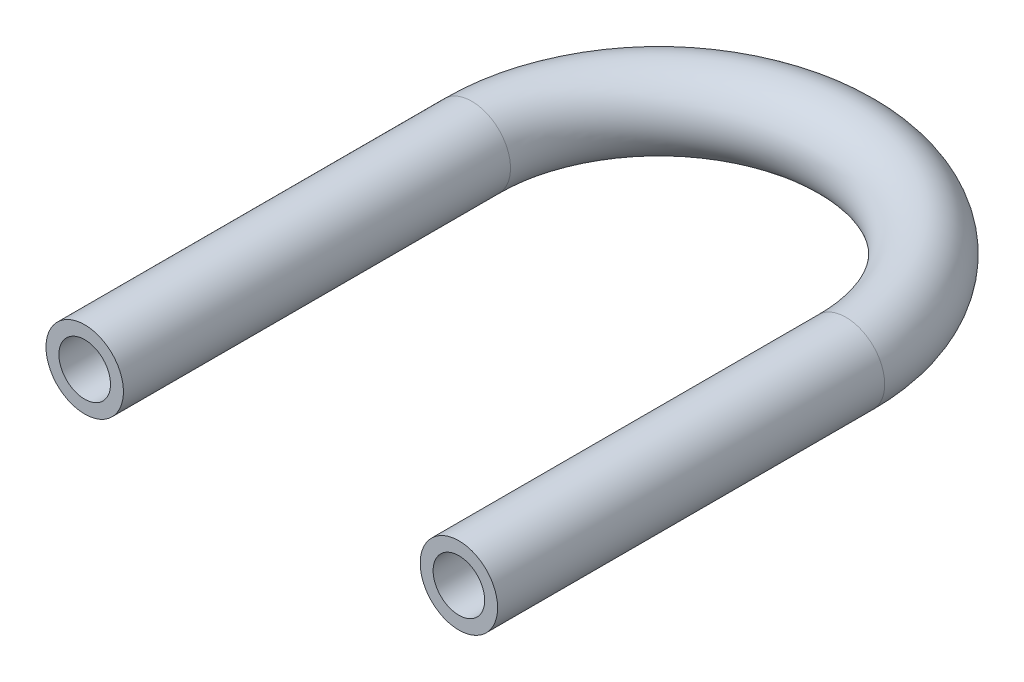
ISO-10303-21;
HEADER;
FILE_DESCRIPTION(('STEP AP214'),'2;1');
FILE_NAME('part.step','',(''),(''),'','','');
FILE_SCHEMA(('AUTOMOTIVE_DESIGN { 1 0 10303 214 1 1 1 1 }'));
ENDSEC;
DATA;
#1=APPLICATION_CONTEXT('core data for automotive mechanical design processes');
#2=APPLICATION_PROTOCOL_DEFINITION('international standard','automotive_design',2000,#1);
#3=PRODUCT_CONTEXT('',#1,'mechanical');
#4=PRODUCT('Part','Part','',(#3));
#5=PRODUCT_RELATED_PRODUCT_CATEGORY('part','',(#4));
#6=PRODUCT_DEFINITION_FORMATION('','',#4);
#7=PRODUCT_DEFINITION_CONTEXT('part definition',#1,'design');
#8=PRODUCT_DEFINITION('design','',#6,#7);
#9=PRODUCT_DEFINITION_SHAPE('','',#8);
#10=(LENGTH_UNIT() NAMED_UNIT(*) SI_UNIT(.MILLI.,.METRE.));
#11=(NAMED_UNIT(*) PLANE_ANGLE_UNIT() SI_UNIT($,.RADIAN.));
#12=(NAMED_UNIT(*) SI_UNIT($,.STERADIAN.) SOLID_ANGLE_UNIT());
#13=UNCERTAINTY_MEASURE_WITH_UNIT(LENGTH_MEASURE(1.E-05),#10,'distance_accuracy_value','');
#14=(GEOMETRIC_REPRESENTATION_CONTEXT(3) GLOBAL_UNCERTAINTY_ASSIGNED_CONTEXT((#13)) GLOBAL_UNIT_ASSIGNED_CONTEXT((#10,
#11,#12)) REPRESENTATION_CONTEXT('',''));
#15=CARTESIAN_POINT('',(0.,0.,0.));
#16=DIRECTION('',(0.,0.,1.));
#17=DIRECTION('',(1.,0.,0.));
#18=AXIS2_PLACEMENT_3D('',#15,#16,#17);
#19=CARTESIAN_POINT('',(-14.5,0.,30.));
#20=DIRECTION('',(0.,0.,-1.));
#21=DIRECTION('',(-1.,0.,0.));
#22=AXIS2_PLACEMENT_3D('',#19,#20,#21);
#23=CYLINDRICAL_SURFACE('',#22,3.);
#24=CARTESIAN_POINT('',(-14.5,0.,0.));
#25=DIRECTION('',(0.,0.,-1.));
#26=DIRECTION('',(-1.,0.,0.));
#27=AXIS2_PLACEMENT_3D('',#24,#25,#26);
#28=CIRCLE('',#27,3.);
#29=CARTESIAN_POINT('',(-17.5,0.,0.));
#30=VERTEX_POINT('',#29);
#31=EDGE_CURVE('E64',#30,#30,#28,.T.);
#32=ORIENTED_EDGE('',*,*,#31,.F.);
#33=EDGE_LOOP('',(#32));
#34=FACE_BOUND('',#33,.T.);
#35=CARTESIAN_POINT('',(-14.5,0.,30.));
#36=DIRECTION('',(0.,0.,-1.));
#37=DIRECTION('',(-1.,0.,0.));
#38=AXIS2_PLACEMENT_3D('',#35,#36,#37);
#39=CIRCLE('',#38,3.);
#40=CARTESIAN_POINT('',(-17.5,0.,30.));
#41=VERTEX_POINT('',#40);
#42=EDGE_CURVE('E61',#41,#41,#39,.T.);
#43=ORIENTED_EDGE('',*,*,#42,.T.);
#44=EDGE_LOOP('',(#43));
#45=FACE_BOUND('',#44,.T.);
#46=ADVANCED_FACE('F37',(#34,#45),#23,.T.);
#47=CARTESIAN_POINT('',(0.,0.,0.));
#48=DIRECTION('',(0.,-1.,0.));
#49=DIRECTION('',(0.,0.,-1.));
#50=AXIS2_PLACEMENT_3D('',#47,#48,#49);
#51=TOROIDAL_SURFACE('',#50,14.5,3.);
#52=CARTESIAN_POINT('',(14.5,0.,0.));
#53=DIRECTION('',(0.,0.,1.));
#54=DIRECTION('',(1.,0.,0.));
#55=AXIS2_PLACEMENT_3D('',#52,#53,#54);
#56=CIRCLE('',#55,3.);
#57=CARTESIAN_POINT('',(17.5,0.,0.));
#58=VERTEX_POINT('',#57);
#59=EDGE_CURVE('E41',#58,#58,#56,.T.);
#60=CARTESIAN_POINT('',(0.,0.,0.));
#61=DIRECTION('',(0.,-1.,0.));
#62=DIRECTION('',(0.,0.,-1.));
#63=AXIS2_PLACEMENT_3D('',#60,#61,#62);
#64=CIRCLE('',#63,17.5);
#65=EDGE_CURVE('',#30,#58,#64,.T.);
#66=ORIENTED_EDGE('',*,*,#31,.T.);
#67=ORIENTED_EDGE('',*,*,#59,.F.);
#68=ORIENTED_EDGE('',*,*,#65,.T.);
#69=ORIENTED_EDGE('',*,*,#65,.F.);
#70=EDGE_LOOP('',(#66,#68,#67,#69));
#71=FACE_BOUND('',#70,.T.);
#72=ADVANCED_FACE('F74',(#71),#51,.T.);
#73=CARTESIAN_POINT('',(14.5,0.,0.));
#74=DIRECTION('',(0.,0.,1.));
#75=DIRECTION('',(1.,0.,0.));
#76=AXIS2_PLACEMENT_3D('',#73,#74,#75);
#77=CYLINDRICAL_SURFACE('',#76,3.);
#78=CARTESIAN_POINT('',(14.5,0.,30.));
#79=DIRECTION('',(0.,0.,1.));
#80=DIRECTION('',(1.,0.,0.));
#81=AXIS2_PLACEMENT_3D('',#78,#79,#80);
#82=CIRCLE('',#81,3.);
#83=CARTESIAN_POINT('',(17.5,0.,30.));
#84=VERTEX_POINT('',#83);
#85=EDGE_CURVE('E56',#84,#84,#82,.T.);
#86=ORIENTED_EDGE('',*,*,#85,.F.);
#87=EDGE_LOOP('',(#86));
#88=FACE_BOUND('',#87,.T.);
#89=ORIENTED_EDGE('',*,*,#59,.T.);
#90=EDGE_LOOP('',(#89));
#91=FACE_BOUND('',#90,.T.);
#92=ADVANCED_FACE('F39',(#88,#91),#77,.T.);
#93=CARTESIAN_POINT('',(-14.5,0.,30.));
#94=DIRECTION('',(0.,0.,-1.));
#95=DIRECTION('',(-1.,0.,0.));
#96=AXIS2_PLACEMENT_3D('',#93,#94,#95);
#97=PLANE('',#96);
#98=CARTESIAN_POINT('',(-14.5,0.,30.));
#99=DIRECTION('',(0.,0.,-1.));
#100=DIRECTION('',(-1.,0.,0.));
#101=AXIS2_PLACEMENT_3D('',#98,#99,#100);
#102=CIRCLE('',#101,2.);
#103=CARTESIAN_POINT('',(-16.5,0.,30.));
#104=VERTEX_POINT('',#103);
#105=EDGE_CURVE('E60',#104,#104,#102,.F.);
#106=ORIENTED_EDGE('',*,*,#105,.F.);
#107=EDGE_LOOP('',(#106));
#108=FACE_BOUND('',#107,.T.);
#109=ORIENTED_EDGE('',*,*,#42,.F.);
#110=EDGE_LOOP('',(#109));
#111=FACE_BOUND('',#110,.T.);
#112=ADVANCED_FACE('F80',(#108,#111),#97,.F.);
#113=CARTESIAN_POINT('',(14.5,0.,30.));
#114=DIRECTION('',(0.,0.,1.));
#115=DIRECTION('',(1.,0.,0.));
#116=AXIS2_PLACEMENT_3D('',#113,#114,#115);
#117=PLANE('',#116);
#118=CARTESIAN_POINT('',(14.5,0.,30.));
#119=DIRECTION('',(0.,0.,1.));
#120=DIRECTION('',(1.,0.,0.));
#121=AXIS2_PLACEMENT_3D('',#118,#119,#120);
#122=CIRCLE('',#121,2.);
#123=CARTESIAN_POINT('',(16.5,0.,30.));
#124=VERTEX_POINT('',#123);
#125=EDGE_CURVE('E10',#124,#124,#122,.F.);
#126=ORIENTED_EDGE('',*,*,#125,.T.);
#127=EDGE_LOOP('',(#126));
#128=FACE_BOUND('',#127,.T.);
#129=ORIENTED_EDGE('',*,*,#85,.T.);
#130=EDGE_LOOP('',(#129));
#131=FACE_BOUND('',#130,.T.);
#132=ADVANCED_FACE('F98',(#128,#131),#117,.T.);
#133=CARTESIAN_POINT('',(-14.5,0.,30.));
#134=DIRECTION('',(0.,0.,-1.));
#135=DIRECTION('',(-1.,0.,0.));
#136=AXIS2_PLACEMENT_3D('',#133,#134,#135);
#137=CYLINDRICAL_SURFACE('',#136,2.);
#138=CARTESIAN_POINT('',(-14.5,0.,0.));
#139=DIRECTION('',(0.,0.,-1.));
#140=DIRECTION('',(-1.,0.,0.));
#141=AXIS2_PLACEMENT_3D('',#138,#139,#140);
#142=CIRCLE('',#141,2.);
#143=CARTESIAN_POINT('',(-16.5,0.,0.));
#144=VERTEX_POINT('',#143);
#145=EDGE_CURVE('E52',#144,#144,#142,.F.);
#146=ORIENTED_EDGE('',*,*,#145,.F.);
#147=EDGE_LOOP('',(#146));
#148=FACE_BOUND('',#147,.T.);
#149=ORIENTED_EDGE('',*,*,#105,.T.);
#150=EDGE_LOOP('',(#149));
#151=FACE_BOUND('',#150,.T.);
#152=ADVANCED_FACE('F92',(#148,#151),#137,.F.);
#153=CARTESIAN_POINT('',(0.,0.,0.));
#154=DIRECTION('',(0.,-1.,0.));
#155=DIRECTION('',(0.,0.,-1.));
#156=AXIS2_PLACEMENT_3D('',#153,#154,#155);
#157=TOROIDAL_SURFACE('',#156,14.5,2.);
#158=CARTESIAN_POINT('',(14.5,0.,0.));
#159=DIRECTION('',(0.,0.,1.));
#160=DIRECTION('',(1.,0.,0.));
#161=AXIS2_PLACEMENT_3D('',#158,#159,#160);
#162=CIRCLE('',#161,2.);
#163=CARTESIAN_POINT('',(16.5,0.,0.));
#164=VERTEX_POINT('',#163);
#165=EDGE_CURVE('E46',#164,#164,#162,.F.);
#166=CARTESIAN_POINT('',(0.,0.,0.));
#167=DIRECTION('',(0.,-1.,0.));
#168=DIRECTION('',(0.,0.,-1.));
#169=AXIS2_PLACEMENT_3D('',#166,#167,#168);
#170=CIRCLE('',#169,16.5);
#171=EDGE_CURVE('',#144,#164,#170,.T.);
#172=ORIENTED_EDGE('',*,*,#145,.T.);
#173=ORIENTED_EDGE('',*,*,#165,.F.);
#174=ORIENTED_EDGE('',*,*,#171,.T.);
#175=ORIENTED_EDGE('',*,*,#171,.F.);
#176=EDGE_LOOP('',(#172,#174,#173,#175));
#177=FACE_BOUND('',#176,.T.);
#178=ADVANCED_FACE('F86',(#177),#157,.F.);
#179=CARTESIAN_POINT('',(14.5,0.,0.));
#180=DIRECTION('',(0.,0.,1.));
#181=DIRECTION('',(1.,0.,0.));
#182=AXIS2_PLACEMENT_3D('',#179,#180,#181);
#183=CYLINDRICAL_SURFACE('',#182,2.);
#184=ORIENTED_EDGE('',*,*,#125,.F.);
#185=EDGE_LOOP('',(#184));
#186=FACE_BOUND('',#185,.T.);
#187=ORIENTED_EDGE('',*,*,#165,.T.);
#188=EDGE_LOOP('',(#187));
#189=FACE_BOUND('',#188,.T.);
#190=ADVANCED_FACE('F84',(#186,#189),#183,.F.);
#191=CLOSED_SHELL('',(#46,#72,#92,#112,#132,#152,#178,#190));
#192=MANIFOLD_SOLID_BREP('B2',#191);
#193=ADVANCED_BREP_SHAPE_REPRESENTATION('',(#18,#192),#14);
#194=SHAPE_DEFINITION_REPRESENTATION(#9,#193);
ENDSEC;
END-ISO-10303-21;
